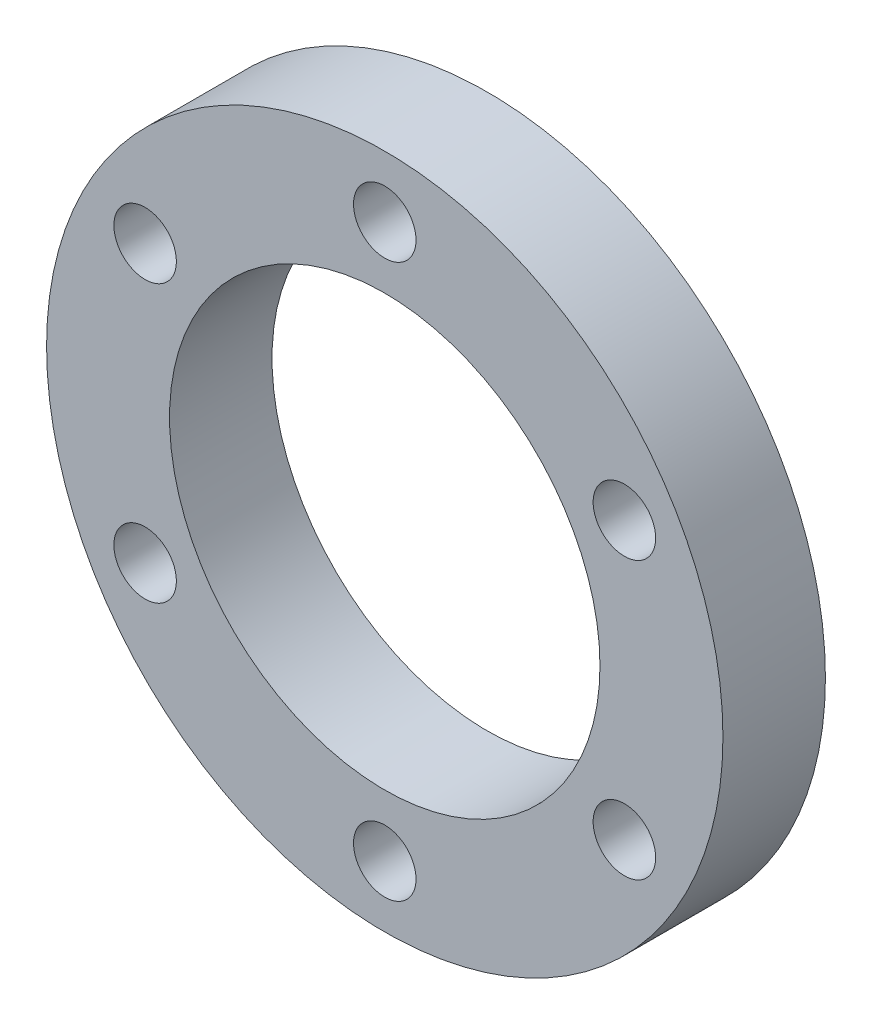
ISO-10303-21;
HEADER;
FILE_DESCRIPTION(('STEP AP214'),'2;1');
FILE_NAME('part.step','',(''),(''),'','','');
FILE_SCHEMA(('AUTOMOTIVE_DESIGN { 1 0 10303 214 1 1 1 1 }'));
ENDSEC;
DATA;
#1=APPLICATION_CONTEXT('core data for automotive mechanical design processes');
#2=APPLICATION_PROTOCOL_DEFINITION('international standard','automotive_design',2000,#1);
#3=PRODUCT_CONTEXT('',#1,'mechanical');
#4=PRODUCT('Part','Part','',(#3));
#5=PRODUCT_RELATED_PRODUCT_CATEGORY('part','',(#4));
#6=PRODUCT_DEFINITION_FORMATION('','',#4);
#7=PRODUCT_DEFINITION_CONTEXT('part definition',#1,'design');
#8=PRODUCT_DEFINITION('design','',#6,#7);
#9=PRODUCT_DEFINITION_SHAPE('','',#8);
#10=(LENGTH_UNIT() NAMED_UNIT(*) SI_UNIT(.MILLI.,.METRE.));
#11=(NAMED_UNIT(*) PLANE_ANGLE_UNIT() SI_UNIT($,.RADIAN.));
#12=(NAMED_UNIT(*) SI_UNIT($,.STERADIAN.) SOLID_ANGLE_UNIT());
#13=UNCERTAINTY_MEASURE_WITH_UNIT(LENGTH_MEASURE(1.E-05),#10,'distance_accuracy_value','');
#14=(GEOMETRIC_REPRESENTATION_CONTEXT(3) GLOBAL_UNCERTAINTY_ASSIGNED_CONTEXT((#13)) GLOBAL_UNIT_ASSIGNED_CONTEXT((#10,
#11,#12)) REPRESENTATION_CONTEXT('',''));
#15=CARTESIAN_POINT('',(0.,0.,0.));
#16=DIRECTION('',(0.,0.,1.));
#17=DIRECTION('',(1.,0.,0.));
#18=AXIS2_PLACEMENT_3D('',#15,#16,#17);
#19=CARTESIAN_POINT('',(0.,0.,5.));
#20=DIRECTION('',(0.,0.,1.));
#21=DIRECTION('',(1.,0.,0.));
#22=AXIS2_PLACEMENT_3D('',#19,#20,#21);
#23=PLANE('',#22);
#24=CARTESIAN_POINT('',(-11.6913429510899,6.74999999999999,5.));
#25=DIRECTION('',(0.,0.,1.));
#26=DIRECTION('',(1.,0.,0.));
#27=AXIS2_PLACEMENT_3D('',#24,#25,#26);
#28=CIRCLE('',#27,1.525);
#29=CARTESIAN_POINT('',(-10.1663429510899,6.74999999999999,5.));
#30=VERTEX_POINT('',#29);
#31=EDGE_CURVE('E74',#30,#30,#28,.T.);
#32=ORIENTED_EDGE('',*,*,#31,.F.);
#33=EDGE_LOOP('',(#32));
#34=FACE_BOUND('',#33,.T.);
#35=CARTESIAN_POINT('',(0.,-13.5,5.));
#36=DIRECTION('',(0.,0.,1.));
#37=DIRECTION('',(1.,0.,0.));
#38=AXIS2_PLACEMENT_3D('',#35,#36,#37);
#39=CIRCLE('',#38,1.525);
#40=CARTESIAN_POINT('',(1.525,-13.5,5.));
#41=VERTEX_POINT('',#40);
#42=EDGE_CURVE('E62',#41,#41,#39,.T.);
#43=ORIENTED_EDGE('',*,*,#42,.F.);
#44=EDGE_LOOP('',(#43));
#45=FACE_BOUND('',#44,.T.);
#46=CARTESIAN_POINT('',(11.6913429510899,6.75,5.));
#47=DIRECTION('',(0.,0.,1.));
#48=DIRECTION('',(1.,0.,0.));
#49=AXIS2_PLACEMENT_3D('',#46,#47,#48);
#50=CIRCLE('',#49,1.525);
#51=CARTESIAN_POINT('',(13.2163429510899,6.75,5.));
#52=VERTEX_POINT('',#51);
#53=EDGE_CURVE('E50',#52,#52,#50,.T.);
#54=ORIENTED_EDGE('',*,*,#53,.F.);
#55=EDGE_LOOP('',(#54));
#56=FACE_BOUND('',#55,.T.);
#57=CARTESIAN_POINT('',(0.,0.,5.));
#58=DIRECTION('',(0.,0.,1.));
#59=DIRECTION('',(1.,0.,0.));
#60=AXIS2_PLACEMENT_3D('',#57,#58,#59);
#61=CIRCLE('',#60,16.5);
#62=CARTESIAN_POINT('',(16.5,0.,5.));
#63=VERTEX_POINT('',#62);
#64=EDGE_CURVE('E10',#63,#63,#61,.T.);
#65=ORIENTED_EDGE('',*,*,#64,.T.);
#66=EDGE_LOOP('',(#65));
#67=FACE_BOUND('',#66,.T.);
#68=CARTESIAN_POINT('',(0.,13.5,5.));
#69=DIRECTION('',(0.,0.,1.));
#70=DIRECTION('',(1.,0.,0.));
#71=AXIS2_PLACEMENT_3D('',#68,#69,#70);
#72=CIRCLE('',#71,1.525);
#73=CARTESIAN_POINT('',(1.525,13.5,5.));
#74=VERTEX_POINT('',#73);
#75=EDGE_CURVE('E45',#74,#74,#72,.T.);
#76=ORIENTED_EDGE('',*,*,#75,.F.);
#77=EDGE_LOOP('',(#76));
#78=FACE_BOUND('',#77,.T.);
#79=CARTESIAN_POINT('',(11.6913429510899,-6.75,5.));
#80=DIRECTION('',(0.,0.,1.));
#81=DIRECTION('',(1.,0.,0.));
#82=AXIS2_PLACEMENT_3D('',#79,#80,#81);
#83=CIRCLE('',#82,1.525);
#84=CARTESIAN_POINT('',(13.2163429510899,-6.75,5.));
#85=VERTEX_POINT('',#84);
#86=EDGE_CURVE('E56',#85,#85,#83,.T.);
#87=ORIENTED_EDGE('',*,*,#86,.F.);
#88=EDGE_LOOP('',(#87));
#89=FACE_BOUND('',#88,.T.);
#90=CARTESIAN_POINT('',(-11.6913429510899,-6.75000000000001,5.));
#91=DIRECTION('',(0.,0.,1.));
#92=DIRECTION('',(1.,0.,0.));
#93=AXIS2_PLACEMENT_3D('',#90,#91,#92);
#94=CIRCLE('',#93,1.525);
#95=CARTESIAN_POINT('',(-10.1663429510899,-6.75000000000001,5.));
#96=VERTEX_POINT('',#95);
#97=EDGE_CURVE('E68',#96,#96,#94,.T.);
#98=ORIENTED_EDGE('',*,*,#97,.F.);
#99=EDGE_LOOP('',(#98));
#100=FACE_BOUND('',#99,.T.);
#101=CARTESIAN_POINT('',(0.,0.,5.));
#102=DIRECTION('',(0.,0.,1.));
#103=DIRECTION('',(1.,0.,0.));
#104=AXIS2_PLACEMENT_3D('',#101,#102,#103);
#105=CIRCLE('',#104,10.5);
#106=CARTESIAN_POINT('',(10.5,0.,5.));
#107=VERTEX_POINT('',#106);
#108=EDGE_CURVE('E80',#107,#107,#105,.T.);
#109=ORIENTED_EDGE('',*,*,#108,.F.);
#110=EDGE_LOOP('',(#109));
#111=FACE_BOUND('',#110,.T.);
#112=ADVANCED_FACE('F34',(#34,#45,#56,#67,#78,#89,#100,#111),#23,.T.);
#113=CARTESIAN_POINT('',(0.,0.,0.));
#114=DIRECTION('',(0.,0.,1.));
#115=DIRECTION('',(1.,0.,0.));
#116=AXIS2_PLACEMENT_3D('',#113,#114,#115);
#117=PLANE('',#116);
#118=CARTESIAN_POINT('',(0.,0.,0.));
#119=DIRECTION('',(0.,0.,1.));
#120=DIRECTION('',(1.,0.,0.));
#121=AXIS2_PLACEMENT_3D('',#118,#119,#120);
#122=CIRCLE('',#121,16.5);
#123=CARTESIAN_POINT('',(16.5,0.,0.));
#124=VERTEX_POINT('',#123);
#125=EDGE_CURVE('E38',#124,#124,#122,.T.);
#126=ORIENTED_EDGE('',*,*,#125,.F.);
#127=EDGE_LOOP('',(#126));
#128=FACE_BOUND('',#127,.T.);
#129=CARTESIAN_POINT('',(0.,13.5,0.));
#130=DIRECTION('',(0.,0.,1.));
#131=DIRECTION('',(1.,0.,0.));
#132=AXIS2_PLACEMENT_3D('',#129,#130,#131);
#133=CIRCLE('',#132,1.525);
#134=CARTESIAN_POINT('',(1.525,13.5,0.));
#135=VERTEX_POINT('',#134);
#136=EDGE_CURVE('E47',#135,#135,#133,.T.);
#137=ORIENTED_EDGE('',*,*,#136,.T.);
#138=EDGE_LOOP('',(#137));
#139=FACE_BOUND('',#138,.T.);
#140=CARTESIAN_POINT('',(11.6913429510899,6.75,0.));
#141=DIRECTION('',(0.,0.,1.));
#142=DIRECTION('',(1.,0.,0.));
#143=AXIS2_PLACEMENT_3D('',#140,#141,#142);
#144=CIRCLE('',#143,1.525);
#145=CARTESIAN_POINT('',(13.2163429510899,6.75,0.));
#146=VERTEX_POINT('',#145);
#147=EDGE_CURVE('E53',#146,#146,#144,.T.);
#148=ORIENTED_EDGE('',*,*,#147,.T.);
#149=EDGE_LOOP('',(#148));
#150=FACE_BOUND('',#149,.T.);
#151=CARTESIAN_POINT('',(11.6913429510899,-6.75,0.));
#152=DIRECTION('',(0.,0.,1.));
#153=DIRECTION('',(1.,0.,0.));
#154=AXIS2_PLACEMENT_3D('',#151,#152,#153);
#155=CIRCLE('',#154,1.525);
#156=CARTESIAN_POINT('',(13.2163429510899,-6.75,0.));
#157=VERTEX_POINT('',#156);
#158=EDGE_CURVE('E59',#157,#157,#155,.T.);
#159=ORIENTED_EDGE('',*,*,#158,.T.);
#160=EDGE_LOOP('',(#159));
#161=FACE_BOUND('',#160,.T.);
#162=CARTESIAN_POINT('',(0.,-13.5,0.));
#163=DIRECTION('',(0.,0.,1.));
#164=DIRECTION('',(1.,0.,0.));
#165=AXIS2_PLACEMENT_3D('',#162,#163,#164);
#166=CIRCLE('',#165,1.525);
#167=CARTESIAN_POINT('',(1.525,-13.5,0.));
#168=VERTEX_POINT('',#167);
#169=EDGE_CURVE('E65',#168,#168,#166,.T.);
#170=ORIENTED_EDGE('',*,*,#169,.T.);
#171=EDGE_LOOP('',(#170));
#172=FACE_BOUND('',#171,.T.);
#173=CARTESIAN_POINT('',(-11.6913429510899,-6.75000000000001,0.));
#174=DIRECTION('',(0.,0.,1.));
#175=DIRECTION('',(1.,0.,0.));
#176=AXIS2_PLACEMENT_3D('',#173,#174,#175);
#177=CIRCLE('',#176,1.525);
#178=CARTESIAN_POINT('',(-10.1663429510899,-6.75000000000001,0.));
#179=VERTEX_POINT('',#178);
#180=EDGE_CURVE('E71',#179,#179,#177,.T.);
#181=ORIENTED_EDGE('',*,*,#180,.T.);
#182=EDGE_LOOP('',(#181));
#183=FACE_BOUND('',#182,.T.);
#184=CARTESIAN_POINT('',(-11.6913429510899,6.74999999999999,0.));
#185=DIRECTION('',(0.,0.,1.));
#186=DIRECTION('',(1.,0.,0.));
#187=AXIS2_PLACEMENT_3D('',#184,#185,#186);
#188=CIRCLE('',#187,1.525);
#189=CARTESIAN_POINT('',(-10.1663429510899,6.74999999999999,0.));
#190=VERTEX_POINT('',#189);
#191=EDGE_CURVE('E77',#190,#190,#188,.T.);
#192=ORIENTED_EDGE('',*,*,#191,.T.);
#193=EDGE_LOOP('',(#192));
#194=FACE_BOUND('',#193,.T.);
#195=CARTESIAN_POINT('',(0.,0.,0.));
#196=DIRECTION('',(0.,0.,1.));
#197=DIRECTION('',(1.,0.,0.));
#198=AXIS2_PLACEMENT_3D('',#195,#196,#197);
#199=CIRCLE('',#198,10.5);
#200=CARTESIAN_POINT('',(10.5,0.,0.));
#201=VERTEX_POINT('',#200);
#202=EDGE_CURVE('E83',#201,#201,#199,.T.);
#203=ORIENTED_EDGE('',*,*,#202,.T.);
#204=EDGE_LOOP('',(#203));
#205=FACE_BOUND('',#204,.T.);
#206=ADVANCED_FACE('F93',(#128,#139,#150,#161,#172,#183,#194,#205),#117,.F.);
#207=CARTESIAN_POINT('',(0.,0.,5.));
#208=DIRECTION('',(0.,0.,-1.));
#209=DIRECTION('',(-1.,0.,0.));
#210=AXIS2_PLACEMENT_3D('',#207,#208,#209);
#211=CYLINDRICAL_SURFACE('',#210,16.5);
#212=ORIENTED_EDGE('',*,*,#64,.F.);
#213=EDGE_LOOP('',(#212));
#214=FACE_BOUND('',#213,.T.);
#215=ORIENTED_EDGE('',*,*,#125,.T.);
#216=EDGE_LOOP('',(#215));
#217=FACE_BOUND('',#216,.T.);
#218=ADVANCED_FACE('F36',(#214,#217),#211,.T.);
#219=CARTESIAN_POINT('',(0.,13.5,5.));
#220=DIRECTION('',(0.,0.,-1.));
#221=DIRECTION('',(-1.,0.,0.));
#222=AXIS2_PLACEMENT_3D('',#219,#220,#221);
#223=CYLINDRICAL_SURFACE('',#222,1.525);
#224=ORIENTED_EDGE('',*,*,#75,.T.);
#225=EDGE_LOOP('',(#224));
#226=FACE_BOUND('',#225,.T.);
#227=ORIENTED_EDGE('',*,*,#136,.F.);
#228=EDGE_LOOP('',(#227));
#229=FACE_BOUND('',#228,.T.);
#230=ADVANCED_FACE('F103',(#226,#229),#223,.F.);
#231=CARTESIAN_POINT('',(11.6913429510899,6.75,5.));
#232=DIRECTION('',(0.,0.,-1.));
#233=DIRECTION('',(-1.,0.,0.));
#234=AXIS2_PLACEMENT_3D('',#231,#232,#233);
#235=CYLINDRICAL_SURFACE('',#234,1.525);
#236=ORIENTED_EDGE('',*,*,#53,.T.);
#237=EDGE_LOOP('',(#236));
#238=FACE_BOUND('',#237,.T.);
#239=ORIENTED_EDGE('',*,*,#147,.F.);
#240=EDGE_LOOP('',(#239));
#241=FACE_BOUND('',#240,.T.);
#242=ADVANCED_FACE('F106',(#238,#241),#235,.F.);
#243=CARTESIAN_POINT('',(11.6913429510899,-6.75,5.));
#244=DIRECTION('',(0.,0.,-1.));
#245=DIRECTION('',(-1.,0.,0.));
#246=AXIS2_PLACEMENT_3D('',#243,#244,#245);
#247=CYLINDRICAL_SURFACE('',#246,1.525);
#248=ORIENTED_EDGE('',*,*,#86,.T.);
#249=EDGE_LOOP('',(#248));
#250=FACE_BOUND('',#249,.T.);
#251=ORIENTED_EDGE('',*,*,#158,.F.);
#252=EDGE_LOOP('',(#251));
#253=FACE_BOUND('',#252,.T.);
#254=ADVANCED_FACE('F110',(#250,#253),#247,.F.);
#255=CARTESIAN_POINT('',(0.,-13.5,5.));
#256=DIRECTION('',(0.,0.,-1.));
#257=DIRECTION('',(-1.,0.,0.));
#258=AXIS2_PLACEMENT_3D('',#255,#256,#257);
#259=CYLINDRICAL_SURFACE('',#258,1.525);
#260=ORIENTED_EDGE('',*,*,#42,.T.);
#261=EDGE_LOOP('',(#260));
#262=FACE_BOUND('',#261,.T.);
#263=ORIENTED_EDGE('',*,*,#169,.F.);
#264=EDGE_LOOP('',(#263));
#265=FACE_BOUND('',#264,.T.);
#266=ADVANCED_FACE('F114',(#262,#265),#259,.F.);
#267=CARTESIAN_POINT('',(-11.6913429510899,-6.75000000000001,5.));
#268=DIRECTION('',(0.,0.,-1.));
#269=DIRECTION('',(-1.,0.,0.));
#270=AXIS2_PLACEMENT_3D('',#267,#268,#269);
#271=CYLINDRICAL_SURFACE('',#270,1.525);
#272=ORIENTED_EDGE('',*,*,#97,.T.);
#273=EDGE_LOOP('',(#272));
#274=FACE_BOUND('',#273,.T.);
#275=ORIENTED_EDGE('',*,*,#180,.F.);
#276=EDGE_LOOP('',(#275));
#277=FACE_BOUND('',#276,.T.);
#278=ADVANCED_FACE('F118',(#274,#277),#271,.F.);
#279=CARTESIAN_POINT('',(-11.6913429510899,6.74999999999999,5.));
#280=DIRECTION('',(0.,0.,-1.));
#281=DIRECTION('',(-1.,0.,0.));
#282=AXIS2_PLACEMENT_3D('',#279,#280,#281);
#283=CYLINDRICAL_SURFACE('',#282,1.525);
#284=ORIENTED_EDGE('',*,*,#31,.T.);
#285=EDGE_LOOP('',(#284));
#286=FACE_BOUND('',#285,.T.);
#287=ORIENTED_EDGE('',*,*,#191,.F.);
#288=EDGE_LOOP('',(#287));
#289=FACE_BOUND('',#288,.T.);
#290=ADVANCED_FACE('F122',(#286,#289),#283,.F.);
#291=CARTESIAN_POINT('',(0.,0.,5.));
#292=DIRECTION('',(0.,0.,-1.));
#293=DIRECTION('',(-1.,0.,0.));
#294=AXIS2_PLACEMENT_3D('',#291,#292,#293);
#295=CYLINDRICAL_SURFACE('',#294,10.5);
#296=ORIENTED_EDGE('',*,*,#108,.T.);
#297=EDGE_LOOP('',(#296));
#298=FACE_BOUND('',#297,.T.);
#299=ORIENTED_EDGE('',*,*,#202,.F.);
#300=EDGE_LOOP('',(#299));
#301=FACE_BOUND('',#300,.T.);
#302=ADVANCED_FACE('F89',(#298,#301),#295,.F.);
#303=CLOSED_SHELL('',(#112,#206,#218,#230,#242,#254,#266,#278,#290,#302));
#304=MANIFOLD_SOLID_BREP('B2',#303);
#305=ADVANCED_BREP_SHAPE_REPRESENTATION('',(#18,#304),#14);
#306=SHAPE_DEFINITION_REPRESENTATION(#9,#305);
ENDSEC;
END-ISO-10303-21;
